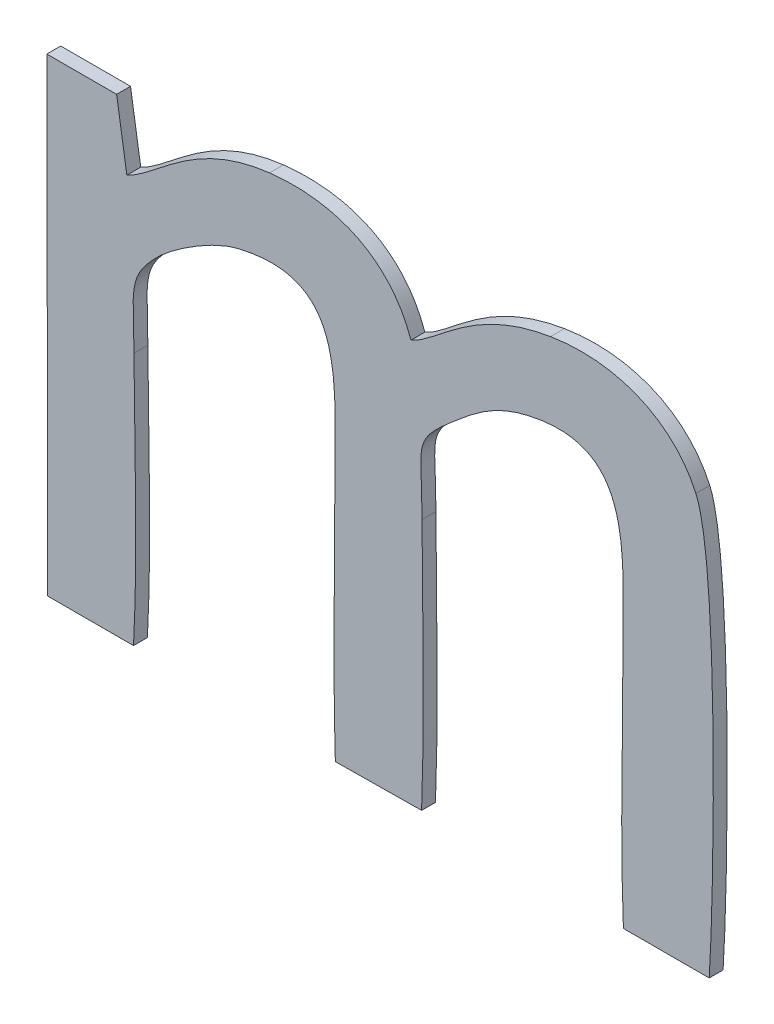
ISO-10303-21;
HEADER;
FILE_DESCRIPTION(('STEP AP214'),'2;1');
FILE_NAME('part.step','',(''),(''),'','','');
FILE_SCHEMA(('AUTOMOTIVE_DESIGN { 1 0 10303 214 1 1 1 1 }'));
ENDSEC;
DATA;
#1=APPLICATION_CONTEXT('core data for automotive mechanical design processes');
#2=APPLICATION_PROTOCOL_DEFINITION('international standard','automotive_design',2000,#1);
#3=PRODUCT_CONTEXT('',#1,'mechanical');
#4=PRODUCT('Part','Part','',(#3));
#5=PRODUCT_RELATED_PRODUCT_CATEGORY('part','',(#4));
#6=PRODUCT_DEFINITION_FORMATION('','',#4);
#7=PRODUCT_DEFINITION_CONTEXT('part definition',#1,'design');
#8=PRODUCT_DEFINITION('design','',#6,#7);
#9=PRODUCT_DEFINITION_SHAPE('','',#8);
#10=(LENGTH_UNIT() NAMED_UNIT(*) SI_UNIT(.MILLI.,.METRE.));
#11=(NAMED_UNIT(*) PLANE_ANGLE_UNIT() SI_UNIT($,.RADIAN.));
#12=(NAMED_UNIT(*) SI_UNIT($,.STERADIAN.) SOLID_ANGLE_UNIT());
#13=UNCERTAINTY_MEASURE_WITH_UNIT(LENGTH_MEASURE(1.E-05),#10,'distance_accuracy_value','');
#14=(GEOMETRIC_REPRESENTATION_CONTEXT(3) GLOBAL_UNCERTAINTY_ASSIGNED_CONTEXT((#13)) GLOBAL_UNIT_ASSIGNED_CONTEXT((#10,
#11,#12)) REPRESENTATION_CONTEXT('',''));
#15=CARTESIAN_POINT('',(0.,0.,0.));
#16=DIRECTION('',(0.,0.,1.));
#17=DIRECTION('',(1.,0.,0.));
#18=AXIS2_PLACEMENT_3D('',#15,#16,#17);
#19=CARTESIAN_POINT('',(-1.8180853125,-48.5519523828125,0.001));
#20=CARTESIAN_POINT('',(-1.8180853125,-48.5519523828125,0.));
#21=CARTESIAN_POINT('',(-1.8193969921875,-48.5481453125,0.001));
#22=CARTESIAN_POINT('',(-1.8193969921875,-48.5481453125,0.));
#23=CARTESIAN_POINT('',(-1.822948125,-48.5460018359375,0.001));
#24=CARTESIAN_POINT('',(-1.822948125,-48.5460018359375,0.));
#25=CARTESIAN_POINT('',(-1.828258828125,-48.5466096875,0.001));
#26=CARTESIAN_POINT('',(-1.828258828125,-48.5466096875,0.));
#27=B_SPLINE_SURFACE_WITH_KNOTS('',3,1,((#19,#20),(#21,#22),(#23,#24),(#25,#26)),.UNSPECIFIED.,
.F.,.F.,.F.,(4,4),(2,2),(0.681818181818182,0.727272727272727),(0.,1.),.UNSPECIFIED.);
#28=CARTESIAN_POINT('',(-1.8180853125,-48.5519523828125,0.));
#29=CARTESIAN_POINT('',(-1.8193969921875,-48.5481453125,0.));
#30=CARTESIAN_POINT('',(-1.822948125,-48.5460018359375,0.));
#31=CARTESIAN_POINT('',(-1.828258828125,-48.5466096875,0.));
#32=B_SPLINE_CURVE_WITH_KNOTS('',3,(#28,#29,#30,#31),.UNSPECIFIED.,.F.,.F.,(4,4),
(0.681818181818182,0.727272727272727),.UNSPECIFIED.);
#33=CARTESIAN_POINT('',(-1.8180853125,-48.5519523828125,0.));
#34=VERTEX_POINT('',#33);
#35=CARTESIAN_POINT('',(-1.828258828125,-48.5466096875,0.));
#36=VERTEX_POINT('',#35);
#37=EDGE_CURVE('E11',#34,#36,#32,.T.);
#38=DIRECTION('',(0.,0.,-1.));
#39=VECTOR('',#38,1.);
#40=CARTESIAN_POINT('',(-1.828258828125,-48.5466096875,0.001));
#41=LINE('',#40,#39);
#42=CARTESIAN_POINT('',(-1.828258828125,-48.5466096875,0.001));
#43=VERTEX_POINT('',#42);
#44=EDGE_CURVE('E28',#43,#36,#41,.T.);
#45=CARTESIAN_POINT('',(-1.8180853125,-48.5519523828125,0.001));
#46=CARTESIAN_POINT('',(-1.8193969921875,-48.5481453125,0.001));
#47=CARTESIAN_POINT('',(-1.822948125,-48.5460018359375,0.001));
#48=CARTESIAN_POINT('',(-1.828258828125,-48.5466096875,0.001));
#49=B_SPLINE_CURVE_WITH_KNOTS('',3,(#45,#46,#47,#48),.UNSPECIFIED.,.F.,.F.,(4,4),
(0.681818181818182,0.727272727272727),.UNSPECIFIED.);
#50=CARTESIAN_POINT('',(-1.8180853125,-48.5519523828125,0.001));
#51=VERTEX_POINT('',#50);
#52=EDGE_CURVE('E459',#51,#43,#49,.T.);
#53=DIRECTION('',(0.,0.,-1.));
#54=VECTOR('',#53,1.);
#55=CARTESIAN_POINT('',(-1.8180853125,-48.5519523828125,0.001));
#56=LINE('',#55,#54);
#57=EDGE_CURVE('E40',#51,#34,#56,.T.);
#58=ORIENTED_EDGE('',*,*,#37,.T.);
#59=ORIENTED_EDGE('',*,*,#44,.F.);
#60=ORIENTED_EDGE('',*,*,#52,.F.);
#61=ORIENTED_EDGE('',*,*,#57,.T.);
#62=EDGE_LOOP('',(#58,#59,#60,#61));
#63=FACE_BOUND('',#62,.T.);
#64=ADVANCED_FACE('F17',(#63),#27,.F.);
#65=CARTESIAN_POINT('',(-1.828258828125,-48.5466096875,0.001));
#66=CARTESIAN_POINT('',(-1.828258828125,-48.5466096875,0.));
#67=CARTESIAN_POINT('',(-1.8338574609375,-48.5472815234375,0.001));
#68=CARTESIAN_POINT('',(-1.8338574609375,-48.5472815234375,0.));
#69=CARTESIAN_POINT('',(-1.8362888671875,-48.5508646484375,0.001));
#70=CARTESIAN_POINT('',(-1.8362888671875,-48.5508646484375,0.));
#71=CARTESIAN_POINT('',(-1.8385283203125,-48.5518883984375,0.001));
#72=CARTESIAN_POINT('',(-1.8385283203125,-48.5518883984375,0.));
#73=B_SPLINE_SURFACE_WITH_KNOTS('',3,1,((#65,#66),(#67,#68),(#69,#70),(#71,#72)),.UNSPECIFIED.,
.F.,.F.,.F.,(4,4),(2,2),(0.727272727272727,0.772727272727273),(0.,1.),.UNSPECIFIED.);
#74=CARTESIAN_POINT('',(-1.828258828125,-48.5466096875,0.));
#75=CARTESIAN_POINT('',(-1.8338574609375,-48.5472815234375,0.));
#76=CARTESIAN_POINT('',(-1.8362888671875,-48.5508646484375,0.));
#77=CARTESIAN_POINT('',(-1.8385283203125,-48.5518883984375,0.));
#78=B_SPLINE_CURVE_WITH_KNOTS('',3,(#74,#75,#76,#77),.UNSPECIFIED.,.F.,.F.,(4,4),
(0.727272727272727,0.772727272727273),.UNSPECIFIED.);
#79=CARTESIAN_POINT('',(-1.8385283203125,-48.5518883984375,0.));
#80=VERTEX_POINT('',#79);
#81=EDGE_CURVE('E451',#36,#80,#78,.T.);
#82=DIRECTION('',(0.,0.,-1.));
#83=VECTOR('',#82,1.);
#84=CARTESIAN_POINT('',(-1.8385283203125,-48.5518883984375,0.001));
#85=LINE('',#84,#83);
#86=CARTESIAN_POINT('',(-1.8385283203125,-48.5518883984375,0.001));
#87=VERTEX_POINT('',#86);
#88=EDGE_CURVE('E446',#87,#80,#85,.T.);
#89=CARTESIAN_POINT('',(-1.828258828125,-48.5466096875,0.001));
#90=CARTESIAN_POINT('',(-1.8338574609375,-48.5472815234375,0.001));
#91=CARTESIAN_POINT('',(-1.8362888671875,-48.5508646484375,0.001));
#92=CARTESIAN_POINT('',(-1.8385283203125,-48.5518883984375,0.001));
#93=B_SPLINE_CURVE_WITH_KNOTS('',3,(#89,#90,#91,#92),.UNSPECIFIED.,.F.,.F.,(4,4),
(0.727272727272727,0.772727272727273),.UNSPECIFIED.);
#94=EDGE_CURVE('E442',#43,#87,#93,.T.);
#95=ORIENTED_EDGE('',*,*,#81,.T.);
#96=ORIENTED_EDGE('',*,*,#88,.F.);
#97=ORIENTED_EDGE('',*,*,#94,.F.);
#98=ORIENTED_EDGE('',*,*,#44,.T.);
#99=EDGE_LOOP('',(#95,#96,#97,#98));
#100=FACE_BOUND('',#99,.T.);
#101=ADVANCED_FACE('F467',(#100),#73,.F.);
#102=CARTESIAN_POINT('',(-9.257372896213,-1.4583532644723,0.001));
#103=DIRECTION('',(-0.987817762671805,-0.155615126996284,0.));
#104=DIRECTION('',(0.155615126996284,-0.987817762671805,0.));
#105=AXIS2_PLACEMENT_3D('',#102,#103,#104);
#106=PLANE('',#105);
#107=DIRECTION('',(-0.155615126996284,0.987817762671805,0.));
#108=VECTOR('',#107,1.);
#109=CARTESIAN_POINT('',(-9.257372896213,-1.4583532644723,0.));
#110=LINE('',#109,#108);
#111=CARTESIAN_POINT('',(-1.839264140625,-48.5472175390625,0.));
#112=VERTEX_POINT('',#111);
#113=EDGE_CURVE('E440',#80,#112,#110,.T.);
#114=ORIENTED_EDGE('',*,*,#113,.T.);
#115=DIRECTION('',(0.,0.,-1.));
#116=VECTOR('',#115,1.);
#117=CARTESIAN_POINT('',(-1.839264140625,-48.5472175390625,0.001));
#118=LINE('',#117,#116);
#119=CARTESIAN_POINT('',(-1.839264140625,-48.5472175390625,0.001));
#120=VERTEX_POINT('',#119);
#121=EDGE_CURVE('E437',#120,#112,#118,.T.);
#122=ORIENTED_EDGE('',*,*,#121,.F.);
#123=DIRECTION('',(-0.155615126996284,0.987817762671805,0.));
#124=VECTOR('',#123,1.);
#125=CARTESIAN_POINT('',(-9.257372896213,-1.4583532644723,0.001));
#126=LINE('',#125,#124);
#127=EDGE_CURVE('E434',#87,#120,#126,.T.);
#128=ORIENTED_EDGE('',*,*,#127,.F.);
#129=ORIENTED_EDGE('',*,*,#88,.T.);
#130=EDGE_LOOP('',(#114,#122,#128,#129));
#131=FACE_BOUND('',#130,.T.);
#132=ADVANCED_FACE('F471',(#131),#106,.F.);
#133=CARTESIAN_POINT('',(0.,-48.5472175390625,0.001));
#134=DIRECTION('',(0.,-1.,0.));
#135=DIRECTION('',(0.,0.,-1.));
#136=AXIS2_PLACEMENT_3D('',#133,#134,#135);
#137=PLANE('',#136);
#138=DIRECTION('',(-1.,0.,0.));
#139=VECTOR('',#138,1.);
#140=CARTESIAN_POINT('',(0.,-48.5472175390625,0.));
#141=LINE('',#140,#139);
#142=CARTESIAN_POINT('',(-1.8442869140625,-48.5472175390625,0.));
#143=VERTEX_POINT('',#142);
#144=EDGE_CURVE('E432',#112,#143,#141,.T.);
#145=ORIENTED_EDGE('',*,*,#144,.T.);
#146=DIRECTION('',(0.,0.,-1.));
#147=VECTOR('',#146,1.);
#148=CARTESIAN_POINT('',(-1.8442869140625,-48.5472175390625,0.001));
#149=LINE('',#148,#147);
#150=CARTESIAN_POINT('',(-1.8442869140625,-48.5472175390625,0.001));
#151=VERTEX_POINT('',#150);
#152=EDGE_CURVE('E429',#151,#143,#149,.T.);
#153=ORIENTED_EDGE('',*,*,#152,.F.);
#154=DIRECTION('',(-1.,0.,0.));
#155=VECTOR('',#154,1.);
#156=CARTESIAN_POINT('',(0.,-48.5472175390625,0.001));
#157=LINE('',#156,#155);
#158=EDGE_CURVE('E426',#120,#151,#157,.T.);
#159=ORIENTED_EDGE('',*,*,#158,.F.);
#160=ORIENTED_EDGE('',*,*,#121,.T.);
#161=EDGE_LOOP('',(#145,#153,#159,#160));
#162=FACE_BOUND('',#161,.T.);
#163=ADVANCED_FACE('F475',(#162),#137,.F.);
#164=CARTESIAN_POINT('',(-1.9363125952079,-0.00367073477764086,0.001));
#165=DIRECTION('',(0.999998203100012,0.0018957311907086,0.));
#166=DIRECTION('',(-0.0018957311907086,0.999998203100012,0.));
#167=AXIS2_PLACEMENT_3D('',#164,#165,#166);
#168=PLANE('',#167);
#169=DIRECTION('',(0.0018957311907086,-0.999998203100012,0.));
#170=VECTOR('',#169,1.);
#171=CARTESIAN_POINT('',(-1.9363125952079,-0.00367073477764086,0.));
#172=LINE('',#171,#170);
#173=CARTESIAN_POINT('',(-1.8442229296875,-48.580969296875,0.));
#174=VERTEX_POINT('',#173);
#175=EDGE_CURVE('E424',#143,#174,#172,.T.);
#176=ORIENTED_EDGE('',*,*,#175,.T.);
#177=DIRECTION('',(0.,0.,-1.));
#178=VECTOR('',#177,1.);
#179=CARTESIAN_POINT('',(-1.8442229296875,-48.580969296875,0.001));
#180=LINE('',#179,#178);
#181=CARTESIAN_POINT('',(-1.8442229296875,-48.580969296875,0.001));
#182=VERTEX_POINT('',#181);
#183=EDGE_CURVE('E421',#182,#174,#180,.T.);
#184=ORIENTED_EDGE('',*,*,#183,.F.);
#185=DIRECTION('',(0.0018957311907086,-0.999998203100012,0.));
#186=VECTOR('',#185,1.);
#187=CARTESIAN_POINT('',(-1.9363125952079,-0.00367073477764086,0.001));
#188=LINE('',#187,#186);
#189=EDGE_CURVE('E418',#151,#182,#188,.T.);
#190=ORIENTED_EDGE('',*,*,#189,.F.);
#191=ORIENTED_EDGE('',*,*,#152,.T.);
#192=EDGE_LOOP('',(#176,#184,#190,#191));
#193=FACE_BOUND('',#192,.T.);
#194=ADVANCED_FACE('F479',(#193),#168,.F.);
#195=CARTESIAN_POINT('',(0.,-48.580969296875,0.001));
#196=DIRECTION('',(0.,1.,0.));
#197=DIRECTION('',(0.,0.,1.));
#198=AXIS2_PLACEMENT_3D('',#195,#196,#197);
#199=PLANE('',#198);
#200=DIRECTION('',(1.,0.,0.));
#201=VECTOR('',#200,1.);
#202=CARTESIAN_POINT('',(0.,-48.580969296875,0.));
#203=LINE('',#202,#201);
#204=CARTESIAN_POINT('',(-1.8380484375,-48.580969296875,0.));
#205=VERTEX_POINT('',#204);
#206=EDGE_CURVE('E416',#174,#205,#203,.T.);
#207=ORIENTED_EDGE('',*,*,#206,.T.);
#208=DIRECTION('',(0.,0.,-1.));
#209=VECTOR('',#208,1.);
#210=CARTESIAN_POINT('',(-1.8380484375,-48.580969296875,0.001));
#211=LINE('',#210,#209);
#212=CARTESIAN_POINT('',(-1.8380484375,-48.580969296875,0.001));
#213=VERTEX_POINT('',#212);
#214=EDGE_CURVE('E413',#213,#205,#211,.T.);
#215=ORIENTED_EDGE('',*,*,#214,.F.);
#216=DIRECTION('',(1.,0.,0.));
#217=VECTOR('',#216,1.);
#218=CARTESIAN_POINT('',(0.,-48.580969296875,0.001));
#219=LINE('',#218,#217);
#220=EDGE_CURVE('E407',#182,#213,#219,.T.);
#221=ORIENTED_EDGE('',*,*,#220,.F.);
#222=ORIENTED_EDGE('',*,*,#183,.T.);
#223=EDGE_LOOP('',(#207,#215,#221,#222));
#224=FACE_BOUND('',#223,.T.);
#225=ADVANCED_FACE('F486',(#224),#199,.F.);
#226=CARTESIAN_POINT('',(-1.8380484375,-48.580969296875,0.001));
#227=CARTESIAN_POINT('',(-1.8380484375,-48.580969296875,0.));
#228=CARTESIAN_POINT('',(-1.837728515625,-48.5751787109375,0.001));
#229=CARTESIAN_POINT('',(-1.837728515625,-48.5751787109375,0.));
#230=CARTESIAN_POINT('',(-1.837984453125,-48.5685883203125,0.001));
#231=CARTESIAN_POINT('',(-1.837984453125,-48.5685883203125,0.));
#232=CARTESIAN_POINT('',(-1.8380164453125,-48.56273375,0.001));
#233=CARTESIAN_POINT('',(-1.8380164453125,-48.56273375,0.));
#234=B_SPLINE_SURFACE_WITH_KNOTS('',3,1,((#226,#227),(#228,#229),(#230,#231),(#232,#233)),
.UNSPECIFIED.,.F.,.F.,.F.,(4,4),(2,2),(0.,0.0454545454545455),(0.,1.),.UNSPECIFIED.);
#235=CARTESIAN_POINT('',(-1.8380484375,-48.580969296875,0.));
#236=CARTESIAN_POINT('',(-1.837728515625,-48.5751787109375,0.));
#237=CARTESIAN_POINT('',(-1.837984453125,-48.5685883203125,0.));
#238=CARTESIAN_POINT('',(-1.8380164453125,-48.56273375,0.));
#239=B_SPLINE_CURVE_WITH_KNOTS('',3,(#235,#236,#237,#238),.UNSPECIFIED.,.F.,.F.,(4,4),(0.,
0.0454545454545455),.UNSPECIFIED.);
#240=CARTESIAN_POINT('',(-1.8380164453125,-48.56273375,0.));
#241=VERTEX_POINT('',#240);
#242=EDGE_CURVE('E402',#205,#241,#239,.T.);
#243=DIRECTION('',(0.,0.,-1.));
#244=VECTOR('',#243,1.);
#245=CARTESIAN_POINT('',(-1.8380164453125,-48.56273375,0.001));
#246=LINE('',#245,#244);
#247=CARTESIAN_POINT('',(-1.8380164453125,-48.56273375,0.001));
#248=VERTEX_POINT('',#247);
#249=EDGE_CURVE('E397',#248,#241,#246,.T.);
#250=CARTESIAN_POINT('',(-1.8380484375,-48.580969296875,0.001));
#251=CARTESIAN_POINT('',(-1.837728515625,-48.5751787109375,0.001));
#252=CARTESIAN_POINT('',(-1.837984453125,-48.5685883203125,0.001));
#253=CARTESIAN_POINT('',(-1.8380164453125,-48.56273375,0.001));
#254=B_SPLINE_CURVE_WITH_KNOTS('',3,(#250,#251,#252,#253),.UNSPECIFIED.,.F.,.F.,(4,4),(0.,
0.0454545454545455),.UNSPECIFIED.);
#255=EDGE_CURVE('E390',#213,#248,#254,.T.);
#256=ORIENTED_EDGE('',*,*,#242,.T.);
#257=ORIENTED_EDGE('',*,*,#249,.F.);
#258=ORIENTED_EDGE('',*,*,#255,.F.);
#259=ORIENTED_EDGE('',*,*,#214,.T.);
#260=EDGE_LOOP('',(#256,#257,#258,#259));
#261=FACE_BOUND('',#260,.T.);
#262=ADVANCED_FACE('F490',(#261),#234,.F.);
#263=CARTESIAN_POINT('',(-1.8380164453125,-48.56273375,0.001));
#264=CARTESIAN_POINT('',(-1.8380164453125,-48.56273375,0.));
#265=CARTESIAN_POINT('',(-1.8380164453125,-48.5587347265625,0.001));
#266=CARTESIAN_POINT('',(-1.8380164453125,-48.5587347265625,0.));
#267=CARTESIAN_POINT('',(-1.8385923046875,-48.5580948828125,0.001));
#268=CARTESIAN_POINT('',(-1.8385923046875,-48.5580948828125,0.));
#269=CARTESIAN_POINT('',(-1.8361608984375,-48.5557274609375,0.001));
#270=CARTESIAN_POINT('',(-1.8361608984375,-48.5557274609375,0.));
#271=B_SPLINE_SURFACE_WITH_KNOTS('',3,1,((#263,#264),(#265,#266),(#267,#268),(#269,#270)),
.UNSPECIFIED.,.F.,.F.,.F.,(4,4),(2,2),(0.0454545454545455,0.0909090909090909),(0.,1.),.UNSPECIFIED.);
#272=CARTESIAN_POINT('',(-1.8380164453125,-48.56273375,0.));
#273=CARTESIAN_POINT('',(-1.8380164453125,-48.5587347265625,0.));
#274=CARTESIAN_POINT('',(-1.8385923046875,-48.5580948828125,0.));
#275=CARTESIAN_POINT('',(-1.8361608984375,-48.5557274609375,0.));
#276=B_SPLINE_CURVE_WITH_KNOTS('',3,(#272,#273,#274,#275),.UNSPECIFIED.,.F.,.F.,(4,4),
(0.0454545454545455,0.0909090909090909),.UNSPECIFIED.);
#277=CARTESIAN_POINT('',(-1.8361608984375,-48.5557274609375,0.));
#278=VERTEX_POINT('',#277);
#279=EDGE_CURVE('E385',#241,#278,#276,.T.);
#280=DIRECTION('',(0.,0.,-1.));
#281=VECTOR('',#280,1.);
#282=CARTESIAN_POINT('',(-1.8361608984375,-48.5557274609375,0.001));
#283=LINE('',#282,#281);
#284=CARTESIAN_POINT('',(-1.8361608984375,-48.5557274609375,0.001));
#285=VERTEX_POINT('',#284);
#286=EDGE_CURVE('E380',#285,#278,#283,.T.);
#287=CARTESIAN_POINT('',(-1.8380164453125,-48.56273375,0.001));
#288=CARTESIAN_POINT('',(-1.8380164453125,-48.5587347265625,0.001));
#289=CARTESIAN_POINT('',(-1.8385923046875,-48.5580948828125,0.001));
#290=CARTESIAN_POINT('',(-1.8361608984375,-48.5557274609375,0.001));
#291=B_SPLINE_CURVE_WITH_KNOTS('',3,(#287,#288,#289,#290),.UNSPECIFIED.,.F.,.F.,(4,4),
(0.0454545454545455,0.0909090909090909),.UNSPECIFIED.);
#292=EDGE_CURVE('E373',#248,#285,#291,.T.);
#293=ORIENTED_EDGE('',*,*,#279,.T.);
#294=ORIENTED_EDGE('',*,*,#286,.F.);
#295=ORIENTED_EDGE('',*,*,#292,.F.);
#296=ORIENTED_EDGE('',*,*,#249,.T.);
#297=EDGE_LOOP('',(#293,#294,#295,#296));
#298=FACE_BOUND('',#297,.T.);
#299=ADVANCED_FACE('F497',(#298),#271,.F.);
#300=CARTESIAN_POINT('',(-1.8361608984375,-48.5557274609375,0.001));
#301=CARTESIAN_POINT('',(-1.8361608984375,-48.5557274609375,0.));
#302=CARTESIAN_POINT('',(-1.83510515625,-48.554735703125,0.001));
#303=CARTESIAN_POINT('',(-1.83510515625,-48.554735703125,0.));
#304=CARTESIAN_POINT('',(-1.832481796875,-48.552944140625,0.001));
#305=CARTESIAN_POINT('',(-1.832481796875,-48.552944140625,0.));
#306=CARTESIAN_POINT('',(-1.8305302734375,-48.5524642578125,0.001));
#307=CARTESIAN_POINT('',(-1.8305302734375,-48.5524642578125,0.));
#308=B_SPLINE_SURFACE_WITH_KNOTS('',3,1,((#300,#301),(#302,#303),(#304,#305),(#306,#307)),
.UNSPECIFIED.,.F.,.F.,.F.,(4,4),(2,2),(0.0909090909090909,0.136363636363636),(0.,1.),.UNSPECIFIED.);
#309=CARTESIAN_POINT('',(-1.8361608984375,-48.5557274609375,0.));
#310=CARTESIAN_POINT('',(-1.83510515625,-48.554735703125,0.));
#311=CARTESIAN_POINT('',(-1.832481796875,-48.552944140625,0.));
#312=CARTESIAN_POINT('',(-1.8305302734375,-48.5524642578125,0.));
#313=B_SPLINE_CURVE_WITH_KNOTS('',3,(#309,#310,#311,#312),.UNSPECIFIED.,.F.,.F.,(4,4),
(0.0909090909090909,0.136363636363636),.UNSPECIFIED.);
#314=CARTESIAN_POINT('',(-1.8305302734375,-48.5524642578125,0.));
#315=VERTEX_POINT('',#314);
#316=EDGE_CURVE('E368',#278,#315,#313,.T.);
#317=DIRECTION('',(0.,0.,-1.));
#318=VECTOR('',#317,1.);
#319=CARTESIAN_POINT('',(-1.8305302734375,-48.5524642578125,0.001));
#320=LINE('',#319,#318);
#321=CARTESIAN_POINT('',(-1.8305302734375,-48.5524642578125,0.001));
#322=VERTEX_POINT('',#321);
#323=EDGE_CURVE('E363',#322,#315,#320,.T.);
#324=CARTESIAN_POINT('',(-1.8361608984375,-48.5557274609375,0.001));
#325=CARTESIAN_POINT('',(-1.83510515625,-48.554735703125,0.001));
#326=CARTESIAN_POINT('',(-1.832481796875,-48.552944140625,0.001));
#327=CARTESIAN_POINT('',(-1.8305302734375,-48.5524642578125,0.001));
#328=B_SPLINE_CURVE_WITH_KNOTS('',3,(#324,#325,#326,#327),.UNSPECIFIED.,.F.,.F.,(4,4),
(0.0909090909090909,0.136363636363636),.UNSPECIFIED.);
#329=EDGE_CURVE('E356',#285,#322,#328,.T.);
#330=ORIENTED_EDGE('',*,*,#316,.T.);
#331=ORIENTED_EDGE('',*,*,#323,.F.);
#332=ORIENTED_EDGE('',*,*,#329,.F.);
#333=ORIENTED_EDGE('',*,*,#286,.T.);
#334=EDGE_LOOP('',(#330,#331,#332,#333));
#335=FACE_BOUND('',#334,.T.);
#336=ADVANCED_FACE('F500',(#335),#308,.F.);
#337=CARTESIAN_POINT('',(-1.8305302734375,-48.5524642578125,0.001));
#338=CARTESIAN_POINT('',(-1.8305302734375,-48.5524642578125,0.));
#339=CARTESIAN_POINT('',(-1.822756171875,-48.55057671875,0.001));
#340=CARTESIAN_POINT('',(-1.822756171875,-48.55057671875,0.));
#341=CARTESIAN_POINT('',(-1.8235559765625,-48.55723109375,0.001));
#342=CARTESIAN_POINT('',(-1.8235559765625,-48.55723109375,0.));
#343=CARTESIAN_POINT('',(-1.8235559765625,-48.5631496484375,0.001));
#344=CARTESIAN_POINT('',(-1.8235559765625,-48.5631496484375,0.));
#345=B_SPLINE_SURFACE_WITH_KNOTS('',3,1,((#337,#338),(#339,#340),(#341,#342),(#343,#344)),
.UNSPECIFIED.,.F.,.F.,.F.,(4,4),(2,2),(0.136363636363636,0.181818181818182),(0.,1.),.UNSPECIFIED.);
#346=CARTESIAN_POINT('',(-1.8305302734375,-48.5524642578125,0.));
#347=CARTESIAN_POINT('',(-1.822756171875,-48.55057671875,0.));
#348=CARTESIAN_POINT('',(-1.8235559765625,-48.55723109375,0.));
#349=CARTESIAN_POINT('',(-1.8235559765625,-48.5631496484375,0.));
#350=B_SPLINE_CURVE_WITH_KNOTS('',3,(#346,#347,#348,#349),.UNSPECIFIED.,.F.,.F.,(4,4),
(0.136363636363636,0.181818181818182),.UNSPECIFIED.);
#351=CARTESIAN_POINT('',(-1.8235559765625,-48.5631496484375,0.));
#352=VERTEX_POINT('',#351);
#353=EDGE_CURVE('E351',#315,#352,#350,.T.);
#354=DIRECTION('',(0.,0.,-1.));
#355=VECTOR('',#354,1.);
#356=CARTESIAN_POINT('',(-1.8235559765625,-48.5631496484375,0.001));
#357=LINE('',#356,#355);
#358=CARTESIAN_POINT('',(-1.8235559765625,-48.5631496484375,0.001));
#359=VERTEX_POINT('',#358);
#360=EDGE_CURVE('E346',#359,#352,#357,.T.);
#361=CARTESIAN_POINT('',(-1.8305302734375,-48.5524642578125,0.001));
#362=CARTESIAN_POINT('',(-1.822756171875,-48.55057671875,0.001));
#363=CARTESIAN_POINT('',(-1.8235559765625,-48.55723109375,0.001));
#364=CARTESIAN_POINT('',(-1.8235559765625,-48.5631496484375,0.001));
#365=B_SPLINE_CURVE_WITH_KNOTS('',3,(#361,#362,#363,#364),.UNSPECIFIED.,.F.,.F.,(4,4),
(0.136363636363636,0.181818181818182),.UNSPECIFIED.);
#366=EDGE_CURVE('E339',#322,#359,#365,.T.);
#367=ORIENTED_EDGE('',*,*,#353,.T.);
#368=ORIENTED_EDGE('',*,*,#360,.F.);
#369=ORIENTED_EDGE('',*,*,#366,.F.);
#370=ORIENTED_EDGE('',*,*,#323,.T.);
#371=EDGE_LOOP('',(#367,#368,#369,#370));
#372=FACE_BOUND('',#371,.T.);
#373=ADVANCED_FACE('F505',(#372),#345,.F.);
#374=CARTESIAN_POINT('',(-1.8235559765625,-48.5631496484375,0.001));
#375=CARTESIAN_POINT('',(-1.8235559765625,-48.5631496484375,0.));
#376=CARTESIAN_POINT('',(-1.8235559765625,-48.5689722265625,0.001));
#377=CARTESIAN_POINT('',(-1.8235559765625,-48.5689722265625,0.));
#378=CARTESIAN_POINT('',(-1.8237159375,-48.5749867578125,0.001));
#379=CARTESIAN_POINT('',(-1.8237159375,-48.5749867578125,0.));
#380=CARTESIAN_POINT('',(-1.823523984375,-48.5809373046875,0.001));
#381=CARTESIAN_POINT('',(-1.823523984375,-48.5809373046875,0.));
#382=B_SPLINE_SURFACE_WITH_KNOTS('',3,1,((#374,#375),(#376,#377),(#378,#379),(#380,#381)),
.UNSPECIFIED.,.F.,.F.,.F.,(4,4),(2,2),(0.181818181818182,0.227272727272727),(0.,1.),.UNSPECIFIED.);
#383=CARTESIAN_POINT('',(-1.8235559765625,-48.5631496484375,0.));
#384=CARTESIAN_POINT('',(-1.8235559765625,-48.5689722265625,0.));
#385=CARTESIAN_POINT('',(-1.8237159375,-48.5749867578125,0.));
#386=CARTESIAN_POINT('',(-1.823523984375,-48.5809373046875,0.));
#387=B_SPLINE_CURVE_WITH_KNOTS('',3,(#383,#384,#385,#386),.UNSPECIFIED.,.F.,.F.,(4,4),
(0.181818181818182,0.227272727272727),.UNSPECIFIED.);
#388=CARTESIAN_POINT('',(-1.823523984375,-48.5809373046875,0.));
#389=VERTEX_POINT('',#388);
#390=EDGE_CURVE('E334',#352,#389,#387,.T.);
#391=DIRECTION('',(0.,0.,-1.));
#392=VECTOR('',#391,1.);
#393=CARTESIAN_POINT('',(-1.823523984375,-48.5809373046875,0.001));
#394=LINE('',#393,#392);
#395=CARTESIAN_POINT('',(-1.823523984375,-48.5809373046875,0.001));
#396=VERTEX_POINT('',#395);
#397=EDGE_CURVE('E329',#396,#389,#394,.T.);
#398=CARTESIAN_POINT('',(-1.8235559765625,-48.5631496484375,0.001));
#399=CARTESIAN_POINT('',(-1.8235559765625,-48.5689722265625,0.001));
#400=CARTESIAN_POINT('',(-1.8237159375,-48.5749867578125,0.001));
#401=CARTESIAN_POINT('',(-1.823523984375,-48.5809373046875,0.001));
#402=B_SPLINE_CURVE_WITH_KNOTS('',3,(#398,#399,#400,#401),.UNSPECIFIED.,.F.,.F.,(4,4),
(0.181818181818182,0.227272727272727),.UNSPECIFIED.);
#403=EDGE_CURVE('E325',#359,#396,#402,.T.);
#404=ORIENTED_EDGE('',*,*,#390,.T.);
#405=ORIENTED_EDGE('',*,*,#397,.F.);
#406=ORIENTED_EDGE('',*,*,#403,.F.);
#407=ORIENTED_EDGE('',*,*,#360,.T.);
#408=EDGE_LOOP('',(#404,#405,#406,#407));
#409=FACE_BOUND('',#408,.T.);
#410=ADVANCED_FACE('F511',(#409),#382,.F.);
#411=CARTESIAN_POINT('',(0.500587395861845,-48.5569773935486,0.001));
#412=DIRECTION('',(-0.0103087305539119,0.999946863625446,0.));
#413=DIRECTION('',(-0.999946863625446,-0.0103087305539119,0.));
#414=AXIS2_PLACEMENT_3D('',#411,#412,#413);
#415=PLANE('',#414);
#416=DIRECTION('',(0.999946863625446,0.0103087305539119,0.));
#417=VECTOR('',#416,1.);
#418=CARTESIAN_POINT('',(0.500587395861845,-48.5569773935486,0.));
#419=LINE('',#418,#417);
#420=CARTESIAN_POINT('',(-1.8173175,-48.5808733203125,0.));
#421=VERTEX_POINT('',#420);
#422=EDGE_CURVE('E323',#389,#421,#419,.T.);
#423=ORIENTED_EDGE('',*,*,#422,.T.);
#424=DIRECTION('',(0.,0.,-1.));
#425=VECTOR('',#424,1.);
#426=CARTESIAN_POINT('',(-1.8173175,-48.5808733203125,0.001));
#427=LINE('',#426,#425);
#428=CARTESIAN_POINT('',(-1.8173175,-48.5808733203125,0.001));
#429=VERTEX_POINT('',#428);
#430=EDGE_CURVE('E320',#429,#421,#427,.T.);
#431=ORIENTED_EDGE('',*,*,#430,.F.);
#432=DIRECTION('',(0.999946863625446,0.0103087305539119,0.));
#433=VECTOR('',#432,1.);
#434=CARTESIAN_POINT('',(0.500587395861845,-48.5569773935486,0.001));
#435=LINE('',#434,#433);
#436=EDGE_CURVE('E314',#396,#429,#435,.T.);
#437=ORIENTED_EDGE('',*,*,#436,.F.);
#438=ORIENTED_EDGE('',*,*,#397,.T.);
#439=EDGE_LOOP('',(#423,#431,#437,#438));
#440=FACE_BOUND('',#439,.T.);
#441=ADVANCED_FACE('F515',(#440),#415,.F.);
#442=CARTESIAN_POINT('',(-1.8173175,-48.5808733203125,0.001));
#443=CARTESIAN_POINT('',(-1.8173175,-48.5808733203125,0.));
#444=CARTESIAN_POINT('',(-1.8170935546875,-48.574954765625,0.001));
#445=CARTESIAN_POINT('',(-1.8170935546875,-48.574954765625,0.));
#446=CARTESIAN_POINT('',(-1.817253515625,-48.568684296875,0.001));
#447=CARTESIAN_POINT('',(-1.817253515625,-48.568684296875,0.));
#448=CARTESIAN_POINT('',(-1.8172855078125,-48.56273375,0.001));
#449=CARTESIAN_POINT('',(-1.8172855078125,-48.56273375,0.));
#450=B_SPLINE_SURFACE_WITH_KNOTS('',3,1,((#442,#443),(#444,#445),(#446,#447),(#448,#449)),
.UNSPECIFIED.,.F.,.F.,.F.,(4,4),(2,2),(0.272727272727273,0.318181818181818),(0.,1.),.UNSPECIFIED.);
#451=CARTESIAN_POINT('',(-1.8173175,-48.5808733203125,0.));
#452=CARTESIAN_POINT('',(-1.8170935546875,-48.574954765625,0.));
#453=CARTESIAN_POINT('',(-1.817253515625,-48.568684296875,0.));
#454=CARTESIAN_POINT('',(-1.8172855078125,-48.56273375,0.));
#455=B_SPLINE_CURVE_WITH_KNOTS('',3,(#451,#452,#453,#454),.UNSPECIFIED.,.F.,.F.,(4,4),
(0.272727272727273,0.318181818181818),.UNSPECIFIED.);
#456=CARTESIAN_POINT('',(-1.8172855078125,-48.56273375,0.));
#457=VERTEX_POINT('',#456);
#458=EDGE_CURVE('E309',#421,#457,#455,.T.);
#459=DIRECTION('',(0.,0.,-1.));
#460=VECTOR('',#459,1.);
#461=CARTESIAN_POINT('',(-1.8172855078125,-48.56273375,0.001));
#462=LINE('',#461,#460);
#463=CARTESIAN_POINT('',(-1.8172855078125,-48.56273375,0.001));
#464=VERTEX_POINT('',#463);
#465=EDGE_CURVE('E304',#464,#457,#462,.T.);
#466=CARTESIAN_POINT('',(-1.8173175,-48.5808733203125,0.001));
#467=CARTESIAN_POINT('',(-1.8170935546875,-48.574954765625,0.001));
#468=CARTESIAN_POINT('',(-1.817253515625,-48.568684296875,0.001));
#469=CARTESIAN_POINT('',(-1.8172855078125,-48.56273375,0.001));
#470=B_SPLINE_CURVE_WITH_KNOTS('',3,(#466,#467,#468,#469),.UNSPECIFIED.,.F.,.F.,(4,4),
(0.272727272727273,0.318181818181818),.UNSPECIFIED.);
#471=EDGE_CURVE('E297',#429,#464,#470,.T.);
#472=ORIENTED_EDGE('',*,*,#458,.T.);
#473=ORIENTED_EDGE('',*,*,#465,.F.);
#474=ORIENTED_EDGE('',*,*,#471,.F.);
#475=ORIENTED_EDGE('',*,*,#430,.T.);
#476=EDGE_LOOP('',(#472,#473,#474,#475));
#477=FACE_BOUND('',#476,.T.);
#478=ADVANCED_FACE('F518',(#477),#450,.F.);
#479=CARTESIAN_POINT('',(-1.8172855078125,-48.56273375,0.001));
#480=CARTESIAN_POINT('',(-1.8172855078125,-48.56273375,0.));
#481=CARTESIAN_POINT('',(-1.8172855078125,-48.558062890625,0.001));
#482=CARTESIAN_POINT('',(-1.8172855078125,-48.558062890625,0.));
#483=CARTESIAN_POINT('',(-1.818021328125,-48.5580948828125,0.001));
#484=CARTESIAN_POINT('',(-1.818021328125,-48.5580948828125,0.));
#485=CARTESIAN_POINT('',(-1.81527,-48.55569546875,0.001));
#486=CARTESIAN_POINT('',(-1.81527,-48.55569546875,0.));
#487=B_SPLINE_SURFACE_WITH_KNOTS('',3,1,((#479,#480),(#481,#482),(#483,#484),(#485,#486)),
.UNSPECIFIED.,.F.,.F.,.F.,(4,4),(2,2),(0.318181818181818,0.363636363636364),(0.,1.),.UNSPECIFIED.);
#488=CARTESIAN_POINT('',(-1.8172855078125,-48.56273375,0.));
#489=CARTESIAN_POINT('',(-1.8172855078125,-48.558062890625,0.));
#490=CARTESIAN_POINT('',(-1.818021328125,-48.5580948828125,0.));
#491=CARTESIAN_POINT('',(-1.81527,-48.55569546875,0.));
#492=B_SPLINE_CURVE_WITH_KNOTS('',3,(#488,#489,#490,#491),.UNSPECIFIED.,.F.,.F.,(4,4),
(0.318181818181818,0.363636363636364),.UNSPECIFIED.);
#493=CARTESIAN_POINT('',(-1.81527,-48.55569546875,0.));
#494=VERTEX_POINT('',#493);
#495=EDGE_CURVE('E292',#457,#494,#492,.T.);
#496=DIRECTION('',(0.,0.,-1.));
#497=VECTOR('',#496,1.);
#498=CARTESIAN_POINT('',(-1.81527,-48.55569546875,0.001));
#499=LINE('',#498,#497);
#500=CARTESIAN_POINT('',(-1.81527,-48.55569546875,0.001));
#501=VERTEX_POINT('',#500);
#502=EDGE_CURVE('E287',#501,#494,#499,.T.);
#503=CARTESIAN_POINT('',(-1.8172855078125,-48.56273375,0.001));
#504=CARTESIAN_POINT('',(-1.8172855078125,-48.558062890625,0.001));
#505=CARTESIAN_POINT('',(-1.818021328125,-48.5580948828125,0.001));
#506=CARTESIAN_POINT('',(-1.81527,-48.55569546875,0.001));
#507=B_SPLINE_CURVE_WITH_KNOTS('',3,(#503,#504,#505,#506),.UNSPECIFIED.,.F.,.F.,(4,4),
(0.318181818181818,0.363636363636364),.UNSPECIFIED.);
#508=EDGE_CURVE('E280',#464,#501,#507,.T.);
#509=ORIENTED_EDGE('',*,*,#495,.T.);
#510=ORIENTED_EDGE('',*,*,#502,.F.);
#511=ORIENTED_EDGE('',*,*,#508,.F.);
#512=ORIENTED_EDGE('',*,*,#465,.T.);
#513=EDGE_LOOP('',(#509,#510,#511,#512));
#514=FACE_BOUND('',#513,.T.);
#515=ADVANCED_FACE('F525',(#514),#487,.F.);
#516=CARTESIAN_POINT('',(-1.81527,-48.55569546875,0.001));
#517=CARTESIAN_POINT('',(-1.81527,-48.55569546875,0.));
#518=CARTESIAN_POINT('',(-1.813670390625,-48.554351796875,0.001));
#519=CARTESIAN_POINT('',(-1.813670390625,-48.554351796875,0.));
#520=CARTESIAN_POINT('',(-1.8122307421875,-48.553008125,0.001));
#521=CARTESIAN_POINT('',(-1.8122307421875,-48.553008125,0.));
#522=CARTESIAN_POINT('',(-1.809639375,-48.552432265625,0.001));
#523=CARTESIAN_POINT('',(-1.809639375,-48.552432265625,0.));
#524=B_SPLINE_SURFACE_WITH_KNOTS('',3,1,((#516,#517),(#518,#519),(#520,#521),(#522,#523)),
.UNSPECIFIED.,.F.,.F.,.F.,(4,4),(2,2),(0.363636363636364,0.409090909090909),(0.,1.),.UNSPECIFIED.);
#525=CARTESIAN_POINT('',(-1.81527,-48.55569546875,0.));
#526=CARTESIAN_POINT('',(-1.813670390625,-48.554351796875,0.));
#527=CARTESIAN_POINT('',(-1.8122307421875,-48.553008125,0.));
#528=CARTESIAN_POINT('',(-1.809639375,-48.552432265625,0.));
#529=B_SPLINE_CURVE_WITH_KNOTS('',3,(#525,#526,#527,#528),.UNSPECIFIED.,.F.,.F.,(4,4),
(0.363636363636364,0.409090909090909),.UNSPECIFIED.);
#530=CARTESIAN_POINT('',(-1.809639375,-48.552432265625,0.));
#531=VERTEX_POINT('',#530);
#532=EDGE_CURVE('E275',#494,#531,#529,.T.);
#533=DIRECTION('',(0.,0.,-1.));
#534=VECTOR('',#533,1.);
#535=CARTESIAN_POINT('',(-1.809639375,-48.552432265625,0.001));
#536=LINE('',#535,#534);
#537=CARTESIAN_POINT('',(-1.809639375,-48.552432265625,0.001));
#538=VERTEX_POINT('',#537);
#539=EDGE_CURVE('E270',#538,#531,#536,.T.);
#540=CARTESIAN_POINT('',(-1.81527,-48.55569546875,0.001));
#541=CARTESIAN_POINT('',(-1.813670390625,-48.554351796875,0.001));
#542=CARTESIAN_POINT('',(-1.8122307421875,-48.553008125,0.001));
#543=CARTESIAN_POINT('',(-1.809639375,-48.552432265625,0.001));
#544=B_SPLINE_CURVE_WITH_KNOTS('',3,(#540,#541,#542,#543),.UNSPECIFIED.,.F.,.F.,(4,4),
(0.363636363636364,0.409090909090909),.UNSPECIFIED.);
#545=EDGE_CURVE('E263',#501,#538,#544,.T.);
#546=ORIENTED_EDGE('',*,*,#532,.T.);
#547=ORIENTED_EDGE('',*,*,#539,.F.);
#548=ORIENTED_EDGE('',*,*,#545,.F.);
#549=ORIENTED_EDGE('',*,*,#502,.T.);
#550=EDGE_LOOP('',(#546,#547,#548,#549));
#551=FACE_BOUND('',#550,.T.);
#552=ADVANCED_FACE('F532',(#551),#524,.F.);
#553=CARTESIAN_POINT('',(-1.809639375,-48.552432265625,0.001));
#554=CARTESIAN_POINT('',(-1.809639375,-48.552432265625,0.));
#555=CARTESIAN_POINT('',(-1.80208921875,-48.5507046875,0.001));
#556=CARTESIAN_POINT('',(-1.80208921875,-48.5507046875,0.));
#557=CARTESIAN_POINT('',(-1.8028250390625,-48.5574550390625,0.001));
#558=CARTESIAN_POINT('',(-1.8028250390625,-48.5574550390625,0.));
#559=CARTESIAN_POINT('',(-1.8028250390625,-48.5631496484375,0.001));
#560=CARTESIAN_POINT('',(-1.8028250390625,-48.5631496484375,0.));
#561=B_SPLINE_SURFACE_WITH_KNOTS('',3,1,((#553,#554),(#555,#556),(#557,#558),(#559,#560)),
.UNSPECIFIED.,.F.,.F.,.F.,(4,4),(2,2),(0.409090909090909,0.454545454545455),(0.,1.),.UNSPECIFIED.);
#562=CARTESIAN_POINT('',(-1.809639375,-48.552432265625,0.));
#563=CARTESIAN_POINT('',(-1.80208921875,-48.5507046875,0.));
#564=CARTESIAN_POINT('',(-1.8028250390625,-48.5574550390625,0.));
#565=CARTESIAN_POINT('',(-1.8028250390625,-48.5631496484375,0.));
#566=B_SPLINE_CURVE_WITH_KNOTS('',3,(#562,#563,#564,#565),.UNSPECIFIED.,.F.,.F.,(4,4),
(0.409090909090909,0.454545454545455),.UNSPECIFIED.);
#567=CARTESIAN_POINT('',(-1.8028250390625,-48.5631496484375,0.));
#568=VERTEX_POINT('',#567);
#569=EDGE_CURVE('E258',#531,#568,#566,.T.);
#570=DIRECTION('',(0.,0.,-1.));
#571=VECTOR('',#570,1.);
#572=CARTESIAN_POINT('',(-1.8028250390625,-48.5631496484375,0.001));
#573=LINE('',#572,#571);
#574=CARTESIAN_POINT('',(-1.8028250390625,-48.5631496484375,0.001));
#575=VERTEX_POINT('',#574);
#576=EDGE_CURVE('E253',#575,#568,#573,.T.);
#577=CARTESIAN_POINT('',(-1.809639375,-48.552432265625,0.001));
#578=CARTESIAN_POINT('',(-1.80208921875,-48.5507046875,0.001));
#579=CARTESIAN_POINT('',(-1.8028250390625,-48.5574550390625,0.001));
#580=CARTESIAN_POINT('',(-1.8028250390625,-48.5631496484375,0.001));
#581=B_SPLINE_CURVE_WITH_KNOTS('',3,(#577,#578,#579,#580),.UNSPECIFIED.,.F.,.F.,(4,4),
(0.409090909090909,0.454545454545455),.UNSPECIFIED.);
#582=EDGE_CURVE('E246',#538,#575,#581,.T.);
#583=ORIENTED_EDGE('',*,*,#569,.T.);
#584=ORIENTED_EDGE('',*,*,#576,.F.);
#585=ORIENTED_EDGE('',*,*,#582,.F.);
#586=ORIENTED_EDGE('',*,*,#539,.T.);
#587=EDGE_LOOP('',(#583,#584,#585,#586));
#588=FACE_BOUND('',#587,.T.);
#589=ADVANCED_FACE('F534',(#588),#561,.F.);
#590=CARTESIAN_POINT('',(-1.8028250390625,-48.5631496484375,0.001));
#591=CARTESIAN_POINT('',(-1.8028250390625,-48.5631496484375,0.));
#592=CARTESIAN_POINT('',(-1.8028250390625,-48.568940234375,0.001));
#593=CARTESIAN_POINT('',(-1.8028250390625,-48.568940234375,0.));
#594=CARTESIAN_POINT('',(-1.803048984375,-48.575210703125,0.001));
#595=CARTESIAN_POINT('',(-1.803048984375,-48.575210703125,0.));
#596=CARTESIAN_POINT('',(-1.802793046875,-48.580969296875,0.001));
#597=CARTESIAN_POINT('',(-1.802793046875,-48.580969296875,0.));
#598=B_SPLINE_SURFACE_WITH_KNOTS('',3,1,((#590,#591),(#592,#593),(#594,#595),(#596,#597)),
.UNSPECIFIED.,.F.,.F.,.F.,(4,4),(2,2),(0.454545454545455,0.5),(0.,1.),.UNSPECIFIED.);
#599=CARTESIAN_POINT('',(-1.8028250390625,-48.5631496484375,0.));
#600=CARTESIAN_POINT('',(-1.8028250390625,-48.568940234375,0.));
#601=CARTESIAN_POINT('',(-1.803048984375,-48.575210703125,0.));
#602=CARTESIAN_POINT('',(-1.802793046875,-48.580969296875,0.));
#603=B_SPLINE_CURVE_WITH_KNOTS('',3,(#599,#600,#601,#602),.UNSPECIFIED.,.F.,.F.,(4,4),
(0.454545454545455,0.5),.UNSPECIFIED.);
#604=CARTESIAN_POINT('',(-1.802793046875,-48.580969296875,0.));
#605=VERTEX_POINT('',#604);
#606=EDGE_CURVE('E241',#568,#605,#603,.T.);
#607=DIRECTION('',(0.,0.,-1.));
#608=VECTOR('',#607,1.);
#609=CARTESIAN_POINT('',(-1.802793046875,-48.580969296875,0.001));
#610=LINE('',#609,#608);
#611=CARTESIAN_POINT('',(-1.802793046875,-48.580969296875,0.001));
#612=VERTEX_POINT('',#611);
#613=EDGE_CURVE('E236',#612,#605,#610,.T.);
#614=CARTESIAN_POINT('',(-1.8028250390625,-48.5631496484375,0.001));
#615=CARTESIAN_POINT('',(-1.8028250390625,-48.568940234375,0.001));
#616=CARTESIAN_POINT('',(-1.803048984375,-48.575210703125,0.001));
#617=CARTESIAN_POINT('',(-1.802793046875,-48.580969296875,0.001));
#618=B_SPLINE_CURVE_WITH_KNOTS('',3,(#614,#615,#616,#617),.UNSPECIFIED.,.F.,.F.,(4,4),
(0.454545454545455,0.5),.UNSPECIFIED.);
#619=EDGE_CURVE('E232',#575,#612,#618,.T.);
#620=ORIENTED_EDGE('',*,*,#606,.T.);
#621=ORIENTED_EDGE('',*,*,#613,.F.);
#622=ORIENTED_EDGE('',*,*,#619,.F.);
#623=ORIENTED_EDGE('',*,*,#576,.T.);
#624=EDGE_LOOP('',(#620,#621,#622,#623));
#625=FACE_BOUND('',#624,.T.);
#626=ADVANCED_FACE('F539',(#625),#598,.F.);
#627=CARTESIAN_POINT('',(0.,-48.580969296875,0.001));
#628=DIRECTION('',(0.,1.,0.));
#629=DIRECTION('',(0.,0.,1.));
#630=AXIS2_PLACEMENT_3D('',#627,#628,#629);
#631=PLANE('',#630);
#632=DIRECTION('',(1.,0.,0.));
#633=VECTOR('',#632,1.);
#634=CARTESIAN_POINT('',(0.,-48.580969296875,0.));
#635=LINE('',#634,#633);
#636=CARTESIAN_POINT('',(-1.7966185546875,-48.580969296875,0.));
#637=VERTEX_POINT('',#636);
#638=EDGE_CURVE('E230',#605,#637,#635,.T.);
#639=ORIENTED_EDGE('',*,*,#638,.T.);
#640=DIRECTION('',(0.,0.,-1.));
#641=VECTOR('',#640,1.);
#642=CARTESIAN_POINT('',(-1.7966185546875,-48.580969296875,0.001));
#643=LINE('',#642,#641);
#644=CARTESIAN_POINT('',(-1.7966185546875,-48.580969296875,0.001));
#645=VERTEX_POINT('',#644);
#646=EDGE_CURVE('E227',#645,#637,#643,.T.);
#647=ORIENTED_EDGE('',*,*,#646,.F.);
#648=DIRECTION('',(1.,0.,0.));
#649=VECTOR('',#648,1.);
#650=CARTESIAN_POINT('',(0.,-48.580969296875,0.001));
#651=LINE('',#650,#649);
#652=EDGE_CURVE('E222',#612,#645,#651,.T.);
#653=ORIENTED_EDGE('',*,*,#652,.F.);
#654=ORIENTED_EDGE('',*,*,#613,.T.);
#655=EDGE_LOOP('',(#639,#647,#653,#654));
#656=FACE_BOUND('',#655,.T.);
#657=ADVANCED_FACE('F546',(#656),#631,.F.);
#658=CARTESIAN_POINT('',(-1.7966185546875,-48.580969296875,0.001));
#659=CARTESIAN_POINT('',(-1.7966185546875,-48.580969296875,0.));
#660=CARTESIAN_POINT('',(-1.796266640625,-48.575722578125,0.001));
#661=CARTESIAN_POINT('',(-1.796266640625,-48.575722578125,0.));
#662=CARTESIAN_POINT('',(-1.7959147265625,-48.5548956640625,0.001));
#663=CARTESIAN_POINT('',(-1.7959147265625,-48.5548956640625,0.));
#664=CARTESIAN_POINT('',(-1.7975783203125,-48.5512485546875,0.001));
#665=CARTESIAN_POINT('',(-1.7975783203125,-48.5512485546875,0.));
#666=B_SPLINE_SURFACE_WITH_KNOTS('',3,1,((#658,#659),(#660,#661),(#662,#663),(#664,#665)),
.UNSPECIFIED.,.F.,.F.,.F.,(4,4),(2,2),(0.545454545454545,0.590909090909091),(0.,1.),.UNSPECIFIED.);
#667=CARTESIAN_POINT('',(-1.7966185546875,-48.580969296875,0.));
#668=CARTESIAN_POINT('',(-1.796266640625,-48.575722578125,0.));
#669=CARTESIAN_POINT('',(-1.7959147265625,-48.5548956640625,0.));
#670=CARTESIAN_POINT('',(-1.7975783203125,-48.5512485546875,0.));
#671=B_SPLINE_CURVE_WITH_KNOTS('',3,(#667,#668,#669,#670),.UNSPECIFIED.,.F.,.F.,(4,4),
(0.545454545454545,0.590909090909091),.UNSPECIFIED.);
#672=CARTESIAN_POINT('',(-1.7975783203125,-48.5512485546875,0.));
#673=VERTEX_POINT('',#672);
#674=EDGE_CURVE('E217',#637,#673,#671,.T.);
#675=DIRECTION('',(0.,0.,-1.));
#676=VECTOR('',#675,1.);
#677=CARTESIAN_POINT('',(-1.7975783203125,-48.5512485546875,0.001));
#678=LINE('',#677,#676);
#679=CARTESIAN_POINT('',(-1.7975783203125,-48.5512485546875,0.001));
#680=VERTEX_POINT('',#679);
#681=EDGE_CURVE('E212',#680,#673,#678,.T.);
#682=CARTESIAN_POINT('',(-1.7966185546875,-48.580969296875,0.001));
#683=CARTESIAN_POINT('',(-1.796266640625,-48.575722578125,0.001));
#684=CARTESIAN_POINT('',(-1.7959147265625,-48.5548956640625,0.001));
#685=CARTESIAN_POINT('',(-1.7975783203125,-48.5512485546875,0.001));
#686=B_SPLINE_CURVE_WITH_KNOTS('',3,(#682,#683,#684,#685),.UNSPECIFIED.,.F.,.F.,(4,4),
(0.545454545454545,0.590909090909091),.UNSPECIFIED.);
#687=EDGE_CURVE('E170',#645,#680,#686,.T.);
#688=ORIENTED_EDGE('',*,*,#674,.T.);
#689=ORIENTED_EDGE('',*,*,#681,.F.);
#690=ORIENTED_EDGE('',*,*,#687,.F.);
#691=ORIENTED_EDGE('',*,*,#646,.T.);
#692=EDGE_LOOP('',(#688,#689,#690,#691));
#693=FACE_BOUND('',#692,.T.);
#694=ADVANCED_FACE('F543',(#693),#666,.F.);
#695=CARTESIAN_POINT('',(-1.7975783203125,-48.5512485546875,0.001));
#696=CARTESIAN_POINT('',(-1.7975783203125,-48.5512485546875,0.));
#697=CARTESIAN_POINT('',(-1.7991779296875,-48.547697421875,0.001));
#698=CARTESIAN_POINT('',(-1.7991779296875,-48.547697421875,0.));
#699=CARTESIAN_POINT('',(-1.803176953125,-48.545905859375,0.001));
#700=CARTESIAN_POINT('',(-1.803176953125,-48.545905859375,0.));
#701=CARTESIAN_POINT('',(-1.808039765625,-48.5467056640625,0.001));
#702=CARTESIAN_POINT('',(-1.808039765625,-48.5467056640625,0.));
#703=B_SPLINE_SURFACE_WITH_KNOTS('',3,1,((#695,#696),(#697,#698),(#699,#700),(#701,#702)),
.UNSPECIFIED.,.F.,.F.,.F.,(4,4),(2,2),(0.590909090909091,0.636363636363636),(0.,1.),.UNSPECIFIED.);
#704=CARTESIAN_POINT('',(-1.7975783203125,-48.5512485546875,0.));
#705=CARTESIAN_POINT('',(-1.7991779296875,-48.547697421875,0.));
#706=CARTESIAN_POINT('',(-1.803176953125,-48.545905859375,0.));
#707=CARTESIAN_POINT('',(-1.808039765625,-48.5467056640625,0.));
#708=B_SPLINE_CURVE_WITH_KNOTS('',3,(#704,#705,#706,#707),.UNSPECIFIED.,.F.,.F.,(4,4),
(0.590909090909091,0.636363636363636),.UNSPECIFIED.);
#709=CARTESIAN_POINT('',(-1.808039765625,-48.5467056640625,0.));
#710=VERTEX_POINT('',#709);
#711=EDGE_CURVE('E179',#673,#710,#708,.T.);
#712=DIRECTION('',(0.,0.,-1.));
#713=VECTOR('',#712,1.);
#714=CARTESIAN_POINT('',(-1.808039765625,-48.5467056640625,0.001));
#715=LINE('',#714,#713);
#716=CARTESIAN_POINT('',(-1.808039765625,-48.5467056640625,0.001));
#717=VERTEX_POINT('',#716);
#718=EDGE_CURVE('E173',#717,#710,#715,.T.);
#719=CARTESIAN_POINT('',(-1.7975783203125,-48.5512485546875,0.001));
#720=CARTESIAN_POINT('',(-1.7991779296875,-48.547697421875,0.001));
#721=CARTESIAN_POINT('',(-1.803176953125,-48.545905859375,0.001));
#722=CARTESIAN_POINT('',(-1.808039765625,-48.5467056640625,0.001));
#723=B_SPLINE_CURVE_WITH_KNOTS('',3,(#719,#720,#721,#722),.UNSPECIFIED.,.F.,.F.,(4,4),
(0.590909090909091,0.636363636363636),.UNSPECIFIED.);
#724=EDGE_CURVE('E163',#680,#717,#723,.T.);
#725=ORIENTED_EDGE('',*,*,#711,.T.);
#726=ORIENTED_EDGE('',*,*,#718,.F.);
#727=ORIENTED_EDGE('',*,*,#724,.F.);
#728=ORIENTED_EDGE('',*,*,#681,.T.);
#729=EDGE_LOOP('',(#725,#726,#727,#728));
#730=FACE_BOUND('',#729,.T.);
#731=ADVANCED_FACE('F177',(#730),#703,.F.);
#732=CARTESIAN_POINT('',(-1.808039765625,-48.5467056640625,0.001));
#733=CARTESIAN_POINT('',(-1.808039765625,-48.5467056640625,0.));
#734=CARTESIAN_POINT('',(-1.813734375,-48.5476334375,0.001));
#735=CARTESIAN_POINT('',(-1.813734375,-48.5476334375,0.));
#736=CARTESIAN_POINT('',(-1.81616578125,-48.551152578125,0.001));
#737=CARTESIAN_POINT('',(-1.81616578125,-48.551152578125,0.));
#738=CARTESIAN_POINT('',(-1.8180853125,-48.5519523828125,0.001));
#739=CARTESIAN_POINT('',(-1.8180853125,-48.5519523828125,0.));
#740=B_SPLINE_SURFACE_WITH_KNOTS('',3,1,((#732,#733),(#734,#735),(#736,#737),(#738,#739)),
.UNSPECIFIED.,.F.,.F.,.F.,(4,4),(2,2),(0.636363636363636,0.681818181818182),(0.,1.),.UNSPECIFIED.);
#741=CARTESIAN_POINT('',(-1.808039765625,-48.5467056640625,0.));
#742=CARTESIAN_POINT('',(-1.813734375,-48.5476334375,0.));
#743=CARTESIAN_POINT('',(-1.81616578125,-48.551152578125,0.));
#744=CARTESIAN_POINT('',(-1.8180853125,-48.5519523828125,0.));
#745=B_SPLINE_CURVE_WITH_KNOTS('',3,(#741,#742,#743,#744),.UNSPECIFIED.,.F.,.F.,(4,4),
(0.636363636363636,0.681818181818182),.UNSPECIFIED.);
#746=EDGE_CURVE('E174',#710,#34,#745,.T.);
#747=CARTESIAN_POINT('',(-1.808039765625,-48.5467056640625,0.001));
#748=CARTESIAN_POINT('',(-1.813734375,-48.5476334375,0.001));
#749=CARTESIAN_POINT('',(-1.81616578125,-48.551152578125,0.001));
#750=CARTESIAN_POINT('',(-1.8180853125,-48.5519523828125,0.001));
#751=B_SPLINE_CURVE_WITH_KNOTS('',3,(#747,#748,#749,#750),.UNSPECIFIED.,.F.,.F.,(4,4),
(0.636363636363636,0.681818181818182),.UNSPECIFIED.);
#752=EDGE_CURVE('E167',#717,#51,#751,.T.);
#753=ORIENTED_EDGE('',*,*,#746,.T.);
#754=ORIENTED_EDGE('',*,*,#57,.F.);
#755=ORIENTED_EDGE('',*,*,#752,.F.);
#756=ORIENTED_EDGE('',*,*,#718,.T.);
#757=EDGE_LOOP('',(#753,#754,#755,#756));
#758=FACE_BOUND('',#757,.T.);
#759=ADVANCED_FACE('F184',(#758),#740,.F.);
#760=CARTESIAN_POINT('',(0.,0.,0.001));
#761=DIRECTION('',(0.,0.,1.));
#762=DIRECTION('',(1.,0.,0.));
#763=AXIS2_PLACEMENT_3D('',#760,#761,#762);
#764=PLANE('',#763);
#765=ORIENTED_EDGE('',*,*,#52,.T.);
#766=ORIENTED_EDGE('',*,*,#94,.T.);
#767=ORIENTED_EDGE('',*,*,#127,.T.);
#768=ORIENTED_EDGE('',*,*,#158,.T.);
#769=ORIENTED_EDGE('',*,*,#189,.T.);
#770=ORIENTED_EDGE('',*,*,#220,.T.);
#771=ORIENTED_EDGE('',*,*,#255,.T.);
#772=ORIENTED_EDGE('',*,*,#292,.T.);
#773=ORIENTED_EDGE('',*,*,#329,.T.);
#774=ORIENTED_EDGE('',*,*,#366,.T.);
#775=ORIENTED_EDGE('',*,*,#403,.T.);
#776=ORIENTED_EDGE('',*,*,#436,.T.);
#777=ORIENTED_EDGE('',*,*,#471,.T.);
#778=ORIENTED_EDGE('',*,*,#508,.T.);
#779=ORIENTED_EDGE('',*,*,#545,.T.);
#780=ORIENTED_EDGE('',*,*,#582,.T.);
#781=ORIENTED_EDGE('',*,*,#619,.T.);
#782=ORIENTED_EDGE('',*,*,#652,.T.);
#783=ORIENTED_EDGE('',*,*,#687,.T.);
#784=ORIENTED_EDGE('',*,*,#724,.T.);
#785=ORIENTED_EDGE('',*,*,#752,.T.);
#786=EDGE_LOOP('',(#765,#766,#767,#768,#769,#770,#771,#772,#773,#774,#775,#776,#777,#778,#779,
#780,#781,#782,#783,#784,#785));
#787=FACE_BOUND('',#786,.T.);
#788=ADVANCED_FACE('F165',(#787),#764,.T.);
#789=CARTESIAN_POINT('',(0.,0.,0.));
#790=DIRECTION('',(0.,0.,1.));
#791=DIRECTION('',(1.,0.,0.));
#792=AXIS2_PLACEMENT_3D('',#789,#790,#791);
#793=PLANE('',#792);
#794=ORIENTED_EDGE('',*,*,#37,.F.);
#795=ORIENTED_EDGE('',*,*,#746,.F.);
#796=ORIENTED_EDGE('',*,*,#711,.F.);
#797=ORIENTED_EDGE('',*,*,#674,.F.);
#798=ORIENTED_EDGE('',*,*,#638,.F.);
#799=ORIENTED_EDGE('',*,*,#606,.F.);
#800=ORIENTED_EDGE('',*,*,#569,.F.);
#801=ORIENTED_EDGE('',*,*,#532,.F.);
#802=ORIENTED_EDGE('',*,*,#495,.F.);
#803=ORIENTED_EDGE('',*,*,#458,.F.);
#804=ORIENTED_EDGE('',*,*,#422,.F.);
#805=ORIENTED_EDGE('',*,*,#390,.F.);
#806=ORIENTED_EDGE('',*,*,#353,.F.);
#807=ORIENTED_EDGE('',*,*,#316,.F.);
#808=ORIENTED_EDGE('',*,*,#279,.F.);
#809=ORIENTED_EDGE('',*,*,#242,.F.);
#810=ORIENTED_EDGE('',*,*,#206,.F.);
#811=ORIENTED_EDGE('',*,*,#175,.F.);
#812=ORIENTED_EDGE('',*,*,#144,.F.);
#813=ORIENTED_EDGE('',*,*,#113,.F.);
#814=ORIENTED_EDGE('',*,*,#81,.F.);
#815=EDGE_LOOP('',(#794,#795,#796,#797,#798,#799,#800,#801,#802,#803,#804,#805,#806,#807,#808,
#809,#810,#811,#812,#813,#814));
#816=FACE_BOUND('',#815,.T.);
#817=ADVANCED_FACE('F482',(#816),#793,.F.);
#818=CLOSED_SHELL('',(#64,#101,#132,#163,#194,#225,#262,#299,#336,#373,#410,#441,#478,#515,#552,
#589,#626,#657,#694,#731,#759,#788,#817));
#819=MANIFOLD_SOLID_BREP('B1',#818);
#820=ADVANCED_BREP_SHAPE_REPRESENTATION('',(#18,#819),#14);
#821=SHAPE_DEFINITION_REPRESENTATION(#9,#820);
ENDSEC;
END-ISO-10303-21;
